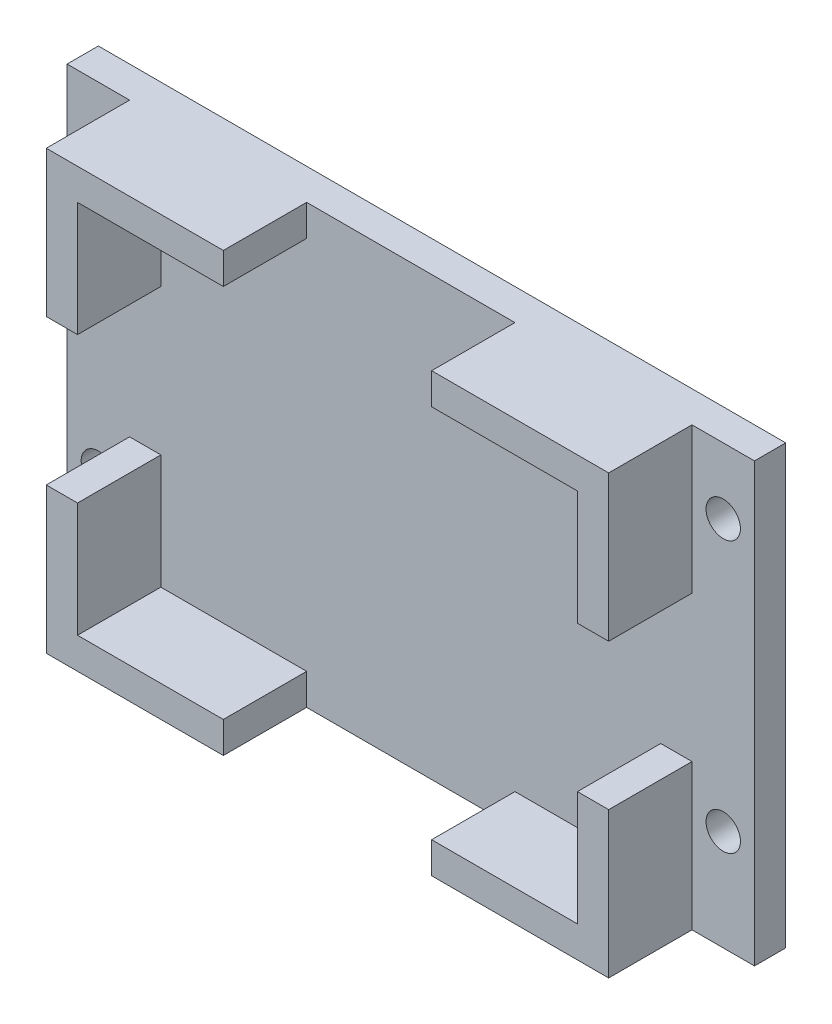
ISO-10303-21;
HEADER;
FILE_DESCRIPTION(('STEP AP214'),'2;1');
FILE_NAME('part.step','',(''),(''),'','','');
FILE_SCHEMA(('AUTOMOTIVE_DESIGN { 1 0 10303 214 1 1 1 1 }'));
ENDSEC;
DATA;
#1=APPLICATION_CONTEXT('core data for automotive mechanical design processes');
#2=APPLICATION_PROTOCOL_DEFINITION('international standard','automotive_design',2000,#1);
#3=PRODUCT_CONTEXT('',#1,'mechanical');
#4=PRODUCT('Part','Part','',(#3));
#5=PRODUCT_RELATED_PRODUCT_CATEGORY('part','',(#4));
#6=PRODUCT_DEFINITION_FORMATION('','',#4);
#7=PRODUCT_DEFINITION_CONTEXT('part definition',#1,'design');
#8=PRODUCT_DEFINITION('design','',#6,#7);
#9=PRODUCT_DEFINITION_SHAPE('','',#8);
#10=(LENGTH_UNIT() NAMED_UNIT(*) SI_UNIT(.MILLI.,.METRE.));
#11=(NAMED_UNIT(*) PLANE_ANGLE_UNIT() SI_UNIT($,.RADIAN.));
#12=(NAMED_UNIT(*) SI_UNIT($,.STERADIAN.) SOLID_ANGLE_UNIT());
#13=UNCERTAINTY_MEASURE_WITH_UNIT(LENGTH_MEASURE(1.E-05),#10,'distance_accuracy_value','');
#14=(GEOMETRIC_REPRESENTATION_CONTEXT(3) GLOBAL_UNCERTAINTY_ASSIGNED_CONTEXT((#13)) GLOBAL_UNIT_ASSIGNED_CONTEXT((#10,
#11,#12)) REPRESENTATION_CONTEXT('',''));
#15=CARTESIAN_POINT('',(0.,0.,0.));
#16=DIRECTION('',(0.,0.,1.));
#17=DIRECTION('',(1.,0.,0.));
#18=AXIS2_PLACEMENT_3D('',#15,#16,#17);
#19=CARTESIAN_POINT('',(0.,0.,11.));
#20=DIRECTION('',(0.,0.,1.));
#21=DIRECTION('',(1.,0.,0.));
#22=AXIS2_PLACEMENT_3D('',#19,#20,#21);
#23=PLANE('',#22);
#24=DIRECTION('',(-1.,0.,0.));
#25=VECTOR('',#24,1.);
#26=CARTESIAN_POINT('',(33.,-6.99999999999999,11.));
#27=LINE('',#26,#25);
#28=CARTESIAN_POINT('',(-24.,-7.,11.));
#29=VERTEX_POINT('',#28);
#30=CARTESIAN_POINT('',(-27.,-7.,11.));
#31=VERTEX_POINT('',#30);
#32=EDGE_CURVE('E601',#29,#31,#27,.T.);
#33=ORIENTED_EDGE('',*,*,#32,.T.);
#34=DIRECTION('',(0.,-1.,0.));
#35=VECTOR('',#34,1.);
#36=CARTESIAN_POINT('',(-27.,21.,11.));
#37=LINE('',#36,#35);
#38=CARTESIAN_POINT('',(-27.,-21.,11.));
#39=VERTEX_POINT('',#38);
#40=EDGE_CURVE('E243',#31,#39,#37,.T.);
#41=ORIENTED_EDGE('',*,*,#40,.T.);
#42=DIRECTION('',(1.,0.,0.));
#43=VECTOR('',#42,1.);
#44=CARTESIAN_POINT('',(-27.,-21.,11.));
#45=LINE('',#44,#43);
#46=CARTESIAN_POINT('',(-10.,-21.,11.));
#47=VERTEX_POINT('',#46);
#48=EDGE_CURVE('E245',#39,#47,#45,.T.);
#49=ORIENTED_EDGE('',*,*,#48,.T.);
#50=DIRECTION('',(0.,1.,0.));
#51=VECTOR('',#50,1.);
#52=CARTESIAN_POINT('',(-10.,-119.75,11.));
#53=LINE('',#52,#51);
#54=CARTESIAN_POINT('',(-10.,-18.,11.));
#55=VERTEX_POINT('',#54);
#56=EDGE_CURVE('E449',#47,#55,#53,.T.);
#57=ORIENTED_EDGE('',*,*,#56,.T.);
#58=DIRECTION('',(1.,0.,0.));
#59=VECTOR('',#58,1.);
#60=CARTESIAN_POINT('',(-24.,-18.,11.));
#61=LINE('',#60,#59);
#62=CARTESIAN_POINT('',(-24.,-18.,11.));
#63=VERTEX_POINT('',#62);
#64=EDGE_CURVE('E339',#63,#55,#61,.T.);
#65=ORIENTED_EDGE('',*,*,#64,.F.);
#66=DIRECTION('',(0.,-1.,0.));
#67=VECTOR('',#66,1.);
#68=CARTESIAN_POINT('',(-24.,18.,11.));
#69=LINE('',#68,#67);
#70=EDGE_CURVE('E473',#29,#63,#69,.T.);
#71=ORIENTED_EDGE('',*,*,#70,.F.);
#72=EDGE_LOOP('',(#33,#41,#49,#57,#65,#71));
#73=FACE_BOUND('',#72,.T.);
#74=ADVANCED_FACE('F36',(#73),#23,.T.);
#75=CARTESIAN_POINT('',(27.,-7.,11.));
#76=VERTEX_POINT('',#75);
#77=CARTESIAN_POINT('',(24.,-7.,11.));
#78=VERTEX_POINT('',#77);
#79=EDGE_CURVE('E427',#76,#78,#27,.T.);
#80=ORIENTED_EDGE('',*,*,#79,.T.);
#81=DIRECTION('',(0.,1.,0.));
#82=VECTOR('',#81,1.);
#83=CARTESIAN_POINT('',(24.,18.,11.));
#84=LINE('',#83,#82);
#85=CARTESIAN_POINT('',(24.,-18.,11.));
#86=VERTEX_POINT('',#85);
#87=EDGE_CURVE('E355',#86,#78,#84,.T.);
#88=ORIENTED_EDGE('',*,*,#87,.F.);
#89=CARTESIAN_POINT('',(10.,-18.,11.));
#90=VERTEX_POINT('',#89);
#91=EDGE_CURVE('E476',#90,#86,#61,.T.);
#92=ORIENTED_EDGE('',*,*,#91,.F.);
#93=DIRECTION('',(0.,1.,0.));
#94=VECTOR('',#93,1.);
#95=CARTESIAN_POINT('',(10.,-119.75,11.));
#96=LINE('',#95,#94);
#97=CARTESIAN_POINT('',(10.,-21.,11.));
#98=VERTEX_POINT('',#97);
#99=EDGE_CURVE('E440',#98,#90,#96,.T.);
#100=ORIENTED_EDGE('',*,*,#99,.F.);
#101=CARTESIAN_POINT('',(27.,-21.,11.));
#102=VERTEX_POINT('',#101);
#103=EDGE_CURVE('E242',#98,#102,#45,.T.);
#104=ORIENTED_EDGE('',*,*,#103,.T.);
#105=DIRECTION('',(0.,1.,0.));
#106=VECTOR('',#105,1.);
#107=CARTESIAN_POINT('',(27.,21.,11.));
#108=LINE('',#107,#106);
#109=EDGE_CURVE('E371',#102,#76,#108,.T.);
#110=ORIENTED_EDGE('',*,*,#109,.T.);
#111=EDGE_LOOP('',(#80,#88,#92,#100,#104,#110));
#112=FACE_BOUND('',#111,.T.);
#113=ADVANCED_FACE('F507',(#112),#23,.T.);
#114=CARTESIAN_POINT('',(27.,21.,11.));
#115=DIRECTION('',(-1.,0.,0.));
#116=DIRECTION('',(0.,-1.,0.));
#117=AXIS2_PLACEMENT_3D('',#114,#115,#116);
#118=PLANE('',#117);
#119=DIRECTION('',(0.,1.,0.));
#120=VECTOR('',#119,1.);
#121=CARTESIAN_POINT('',(27.,21.,3.));
#122=LINE('',#121,#120);
#123=CARTESIAN_POINT('',(27.,-21.,3.));
#124=VERTEX_POINT('',#123);
#125=CARTESIAN_POINT('',(27.,-6.99999999999999,3.));
#126=VERTEX_POINT('',#125);
#127=EDGE_CURVE('E253',#124,#126,#122,.T.);
#128=ORIENTED_EDGE('',*,*,#127,.T.);
#129=DIRECTION('',(0.,0.,1.));
#130=VECTOR('',#129,1.);
#131=CARTESIAN_POINT('',(27.,-6.99999999999999,11.));
#132=LINE('',#131,#130);
#133=EDGE_CURVE('E434',#126,#76,#132,.T.);
#134=ORIENTED_EDGE('',*,*,#133,.T.);
#135=ORIENTED_EDGE('',*,*,#109,.F.);
#136=DIRECTION('',(0.,0.,-1.));
#137=VECTOR('',#136,1.);
#138=CARTESIAN_POINT('',(27.,-21.,11.));
#139=LINE('',#138,#137);
#140=EDGE_CURVE('E252',#102,#124,#139,.T.);
#141=ORIENTED_EDGE('',*,*,#140,.T.);
#142=EDGE_LOOP('',(#128,#134,#135,#141));
#143=FACE_BOUND('',#142,.T.);
#144=ADVANCED_FACE('F514',(#143),#118,.F.);
#145=CARTESIAN_POINT('',(-27.,21.,11.));
#146=DIRECTION('',(1.,0.,0.));
#147=DIRECTION('',(0.,1.,0.));
#148=AXIS2_PLACEMENT_3D('',#145,#146,#147);
#149=PLANE('',#148);
#150=ORIENTED_EDGE('',*,*,#40,.F.);
#151=DIRECTION('',(0.,0.,1.));
#152=VECTOR('',#151,1.);
#153=CARTESIAN_POINT('',(-27.,-7.,3.));
#154=LINE('',#153,#152);
#155=CARTESIAN_POINT('',(-27.,-7.,3.));
#156=VERTEX_POINT('',#155);
#157=EDGE_CURVE('E228',#156,#31,#154,.T.);
#158=ORIENTED_EDGE('',*,*,#157,.F.);
#159=DIRECTION('',(0.,-1.,0.));
#160=VECTOR('',#159,1.);
#161=CARTESIAN_POINT('',(-27.,21.,3.));
#162=LINE('',#161,#160);
#163=CARTESIAN_POINT('',(-27.,-21.,3.));
#164=VERTEX_POINT('',#163);
#165=EDGE_CURVE('E256',#156,#164,#162,.T.);
#166=ORIENTED_EDGE('',*,*,#165,.T.);
#167=DIRECTION('',(0.,0.,-1.));
#168=VECTOR('',#167,1.);
#169=CARTESIAN_POINT('',(-27.,-21.,11.));
#170=LINE('',#169,#168);
#171=EDGE_CURVE('E262',#39,#164,#170,.T.);
#172=ORIENTED_EDGE('',*,*,#171,.F.);
#173=EDGE_LOOP('',(#150,#158,#166,#172));
#174=FACE_BOUND('',#173,.T.);
#175=ADVANCED_FACE('F581',(#174),#149,.F.);
#176=CARTESIAN_POINT('',(24.,18.,11.));
#177=DIRECTION('',(-1.,0.,0.));
#178=DIRECTION('',(0.,0.,1.));
#179=AXIS2_PLACEMENT_3D('',#176,#177,#178);
#180=PLANE('',#179);
#181=DIRECTION('',(0.,0.,1.));
#182=VECTOR('',#181,1.);
#183=CARTESIAN_POINT('',(24.,-6.99999999999999,11.));
#184=LINE('',#183,#182);
#185=CARTESIAN_POINT('',(24.,-7.,3.));
#186=VERTEX_POINT('',#185);
#187=EDGE_CURVE('E432',#186,#78,#184,.T.);
#188=ORIENTED_EDGE('',*,*,#187,.F.);
#189=DIRECTION('',(0.,1.,0.));
#190=VECTOR('',#189,1.);
#191=CARTESIAN_POINT('',(24.,18.,3.));
#192=LINE('',#191,#190);
#193=CARTESIAN_POINT('',(24.,-18.,3.));
#194=VERTEX_POINT('',#193);
#195=EDGE_CURVE('E478',#194,#186,#192,.T.);
#196=ORIENTED_EDGE('',*,*,#195,.F.);
#197=DIRECTION('',(0.,0.,-1.));
#198=VECTOR('',#197,1.);
#199=CARTESIAN_POINT('',(24.,-18.,11.));
#200=LINE('',#199,#198);
#201=EDGE_CURVE('E361',#86,#194,#200,.T.);
#202=ORIENTED_EDGE('',*,*,#201,.F.);
#203=ORIENTED_EDGE('',*,*,#87,.T.);
#204=EDGE_LOOP('',(#188,#196,#202,#203));
#205=FACE_BOUND('',#204,.T.);
#206=ADVANCED_FACE('F586',(#205),#180,.T.);
#207=CARTESIAN_POINT('',(-24.,18.,11.));
#208=DIRECTION('',(1.,0.,0.));
#209=DIRECTION('',(0.,0.,-1.));
#210=AXIS2_PLACEMENT_3D('',#207,#208,#209);
#211=PLANE('',#210);
#212=DIRECTION('',(0.,0.,-1.));
#213=VECTOR('',#212,1.);
#214=CARTESIAN_POINT('',(-24.,-7.,11.));
#215=LINE('',#214,#213);
#216=CARTESIAN_POINT('',(-24.,-7.,3.));
#217=VERTEX_POINT('',#216);
#218=EDGE_CURVE('E430',#29,#217,#215,.T.);
#219=ORIENTED_EDGE('',*,*,#218,.F.);
#220=ORIENTED_EDGE('',*,*,#70,.T.);
#221=DIRECTION('',(0.,0.,-1.));
#222=VECTOR('',#221,1.);
#223=CARTESIAN_POINT('',(-24.,-18.,11.));
#224=LINE('',#223,#222);
#225=CARTESIAN_POINT('',(-24.,-18.,3.));
#226=VERTEX_POINT('',#225);
#227=EDGE_CURVE('E364',#63,#226,#224,.T.);
#228=ORIENTED_EDGE('',*,*,#227,.T.);
#229=DIRECTION('',(0.,-1.,0.));
#230=VECTOR('',#229,1.);
#231=CARTESIAN_POINT('',(-24.,18.,3.));
#232=LINE('',#231,#230);
#233=EDGE_CURVE('E350',#217,#226,#232,.T.);
#234=ORIENTED_EDGE('',*,*,#233,.F.);
#235=EDGE_LOOP('',(#219,#220,#228,#234));
#236=FACE_BOUND('',#235,.T.);
#237=ADVANCED_FACE('F540',(#236),#211,.T.);
#238=CARTESIAN_POINT('',(0.,-21.,3.));
#239=DIRECTION('',(0.,-1.,0.));
#240=DIRECTION('',(0.,0.,-1.));
#241=AXIS2_PLACEMENT_3D('',#238,#239,#240);
#242=PLANE('',#241);
#243=DIRECTION('',(-1.,0.,0.));
#244=VECTOR('',#243,1.);
#245=CARTESIAN_POINT('',(0.,-21.,3.));
#246=LINE('',#245,#244);
#247=CARTESIAN_POINT('',(10.,-21.,3.));
#248=VERTEX_POINT('',#247);
#249=CARTESIAN_POINT('',(-10.,-21.,3.));
#250=VERTEX_POINT('',#249);
#251=EDGE_CURVE('E465',#248,#250,#246,.T.);
#252=ORIENTED_EDGE('',*,*,#251,.T.);
#253=DIRECTION('',(0.,0.,1.));
#254=VECTOR('',#253,1.);
#255=CARTESIAN_POINT('',(-10.,-21.,3.));
#256=LINE('',#255,#254);
#257=EDGE_CURVE('E462',#250,#47,#256,.T.);
#258=ORIENTED_EDGE('',*,*,#257,.T.);
#259=ORIENTED_EDGE('',*,*,#48,.F.);
#260=ORIENTED_EDGE('',*,*,#171,.T.);
#261=DIRECTION('',(-1.,0.,0.));
#262=VECTOR('',#261,1.);
#263=CARTESIAN_POINT('',(0.,-21.,3.));
#264=LINE('',#263,#262);
#265=CARTESIAN_POINT('',(-33.,-21.,3.));
#266=VERTEX_POINT('',#265);
#267=EDGE_CURVE('E278',#164,#266,#264,.T.);
#268=ORIENTED_EDGE('',*,*,#267,.T.);
#269=DIRECTION('',(0.,0.,-1.));
#270=VECTOR('',#269,1.);
#271=CARTESIAN_POINT('',(-33.,-21.,3.));
#272=LINE('',#271,#270);
#273=CARTESIAN_POINT('',(-33.,-21.,0.));
#274=VERTEX_POINT('',#273);
#275=EDGE_CURVE('E297',#266,#274,#272,.T.);
#276=ORIENTED_EDGE('',*,*,#275,.T.);
#277=DIRECTION('',(-1.,0.,0.));
#278=VECTOR('',#277,1.);
#279=CARTESIAN_POINT('',(0.,-21.,0.));
#280=LINE('',#279,#278);
#281=CARTESIAN_POINT('',(33.,-21.,0.));
#282=VERTEX_POINT('',#281);
#283=EDGE_CURVE('E303',#282,#274,#280,.T.);
#284=ORIENTED_EDGE('',*,*,#283,.F.);
#285=DIRECTION('',(0.,0.,-1.));
#286=VECTOR('',#285,1.);
#287=CARTESIAN_POINT('',(33.,-21.,3.));
#288=LINE('',#287,#286);
#289=CARTESIAN_POINT('',(33.,-21.,3.));
#290=VERTEX_POINT('',#289);
#291=EDGE_CURVE('E326',#290,#282,#288,.T.);
#292=ORIENTED_EDGE('',*,*,#291,.F.);
#293=EDGE_CURVE('E279',#290,#124,#264,.T.);
#294=ORIENTED_EDGE('',*,*,#293,.T.);
#295=ORIENTED_EDGE('',*,*,#140,.F.);
#296=ORIENTED_EDGE('',*,*,#103,.F.);
#297=DIRECTION('',(0.,0.,-1.));
#298=VECTOR('',#297,1.);
#299=CARTESIAN_POINT('',(10.,-21.,3.));
#300=LINE('',#299,#298);
#301=EDGE_CURVE('E454',#98,#248,#300,.T.);
#302=ORIENTED_EDGE('',*,*,#301,.T.);
#303=EDGE_LOOP('',(#252,#258,#259,#260,#268,#276,#284,#292,#294,#295,#296,#302));
#304=FACE_BOUND('',#303,.T.);
#305=ADVANCED_FACE('F410',(#304),#242,.T.);
#306=CARTESIAN_POINT('',(0.,21.,3.));
#307=DIRECTION('',(0.,-1.,0.));
#308=DIRECTION('',(0.,0.,-1.));
#309=AXIS2_PLACEMENT_3D('',#306,#307,#308);
#310=PLANE('',#309);
#311=DIRECTION('',(0.,0.,1.));
#312=VECTOR('',#311,1.);
#313=CARTESIAN_POINT('',(-10.,21.,3.));
#314=LINE('',#313,#312);
#315=CARTESIAN_POINT('',(-10.,21.,3.));
#316=VERTEX_POINT('',#315);
#317=CARTESIAN_POINT('',(-10.,21.,11.));
#318=VERTEX_POINT('',#317);
#319=EDGE_CURVE('E460',#316,#318,#314,.T.);
#320=ORIENTED_EDGE('',*,*,#319,.F.);
#321=DIRECTION('',(-1.,0.,0.));
#322=VECTOR('',#321,1.);
#323=CARTESIAN_POINT('',(0.,21.,3.));
#324=LINE('',#323,#322);
#325=CARTESIAN_POINT('',(10.,21.,3.));
#326=VERTEX_POINT('',#325);
#327=EDGE_CURVE('E11',#326,#316,#324,.T.);
#328=ORIENTED_EDGE('',*,*,#327,.F.);
#329=DIRECTION('',(0.,0.,-1.));
#330=VECTOR('',#329,1.);
#331=CARTESIAN_POINT('',(10.,21.,3.));
#332=LINE('',#331,#330);
#333=CARTESIAN_POINT('',(10.,21.,11.));
#334=VERTEX_POINT('',#333);
#335=EDGE_CURVE('E392',#334,#326,#332,.T.);
#336=ORIENTED_EDGE('',*,*,#335,.F.);
#337=DIRECTION('',(-1.,0.,0.));
#338=VECTOR('',#337,1.);
#339=CARTESIAN_POINT('',(-27.,21.,11.));
#340=LINE('',#339,#338);
#341=CARTESIAN_POINT('',(27.,21.,11.));
#342=VERTEX_POINT('',#341);
#343=EDGE_CURVE('E247',#342,#334,#340,.T.);
#344=ORIENTED_EDGE('',*,*,#343,.F.);
#345=DIRECTION('',(0.,0.,-1.));
#346=VECTOR('',#345,1.);
#347=CARTESIAN_POINT('',(27.,21.,11.));
#348=LINE('',#347,#346);
#349=CARTESIAN_POINT('',(27.,21.,3.));
#350=VERTEX_POINT('',#349);
#351=EDGE_CURVE('E267',#342,#350,#348,.T.);
#352=ORIENTED_EDGE('',*,*,#351,.T.);
#353=DIRECTION('',(-1.,0.,0.));
#354=VECTOR('',#353,1.);
#355=CARTESIAN_POINT('',(0.,21.,3.));
#356=LINE('',#355,#354);
#357=CARTESIAN_POINT('',(33.,21.,3.));
#358=VERTEX_POINT('',#357);
#359=EDGE_CURVE('E285',#358,#350,#356,.T.);
#360=ORIENTED_EDGE('',*,*,#359,.F.);
#361=DIRECTION('',(0.,0.,-1.));
#362=VECTOR('',#361,1.);
#363=CARTESIAN_POINT('',(33.,21.,3.));
#364=LINE('',#363,#362);
#365=CARTESIAN_POINT('',(33.,21.,0.));
#366=VERTEX_POINT('',#365);
#367=EDGE_CURVE('E324',#358,#366,#364,.T.);
#368=ORIENTED_EDGE('',*,*,#367,.T.);
#369=DIRECTION('',(-1.,0.,0.));
#370=VECTOR('',#369,1.);
#371=CARTESIAN_POINT('',(0.,21.,0.));
#372=LINE('',#371,#370);
#373=CARTESIAN_POINT('',(-33.,21.,0.));
#374=VERTEX_POINT('',#373);
#375=EDGE_CURVE('E309',#366,#374,#372,.T.);
#376=ORIENTED_EDGE('',*,*,#375,.T.);
#377=DIRECTION('',(0.,0.,-1.));
#378=VECTOR('',#377,1.);
#379=CARTESIAN_POINT('',(-33.,21.,3.));
#380=LINE('',#379,#378);
#381=CARTESIAN_POINT('',(-33.,21.,3.));
#382=VERTEX_POINT('',#381);
#383=EDGE_CURVE('E321',#382,#374,#380,.T.);
#384=ORIENTED_EDGE('',*,*,#383,.F.);
#385=CARTESIAN_POINT('',(-27.,21.,3.));
#386=VERTEX_POINT('',#385);
#387=EDGE_CURVE('E284',#386,#382,#356,.T.);
#388=ORIENTED_EDGE('',*,*,#387,.F.);
#389=DIRECTION('',(0.,0.,-1.));
#390=VECTOR('',#389,1.);
#391=CARTESIAN_POINT('',(-27.,21.,11.));
#392=LINE('',#391,#390);
#393=CARTESIAN_POINT('',(-27.,21.,11.));
#394=VERTEX_POINT('',#393);
#395=EDGE_CURVE('E265',#394,#386,#392,.T.);
#396=ORIENTED_EDGE('',*,*,#395,.F.);
#397=EDGE_CURVE('E240',#318,#394,#340,.T.);
#398=ORIENTED_EDGE('',*,*,#397,.F.);
#399=EDGE_LOOP('',(#320,#328,#336,#344,#352,#360,#368,#376,#384,#388,#396,#398));
#400=FACE_BOUND('',#399,.T.);
#401=ADVANCED_FACE('F389',(#400),#310,.F.);
#402=DIRECTION('',(-1.,0.,0.));
#403=VECTOR('',#402,1.);
#404=CARTESIAN_POINT('',(33.,7.00000000000001,11.));
#405=LINE('',#404,#403);
#406=CARTESIAN_POINT('',(-24.,7.,11.));
#407=VERTEX_POINT('',#406);
#408=CARTESIAN_POINT('',(-27.,7.,11.));
#409=VERTEX_POINT('',#408);
#410=EDGE_CURVE('E218',#407,#409,#405,.T.);
#411=ORIENTED_EDGE('',*,*,#410,.F.);
#412=CARTESIAN_POINT('',(-24.,18.,11.));
#413=VERTEX_POINT('',#412);
#414=EDGE_CURVE('E474',#413,#407,#69,.T.);
#415=ORIENTED_EDGE('',*,*,#414,.F.);
#416=DIRECTION('',(-1.,0.,0.));
#417=VECTOR('',#416,1.);
#418=CARTESIAN_POINT('',(-24.,18.,11.));
#419=LINE('',#418,#417);
#420=CARTESIAN_POINT('',(-10.,17.9999999999999,11.));
#421=VERTEX_POINT('',#420);
#422=EDGE_CURVE('E469',#421,#413,#419,.T.);
#423=ORIENTED_EDGE('',*,*,#422,.F.);
#424=EDGE_CURVE('E447',#421,#318,#53,.T.);
#425=ORIENTED_EDGE('',*,*,#424,.T.);
#426=ORIENTED_EDGE('',*,*,#397,.T.);
#427=EDGE_CURVE('E234',#394,#409,#37,.T.);
#428=ORIENTED_EDGE('',*,*,#427,.T.);
#429=EDGE_LOOP('',(#411,#415,#423,#425,#426,#428));
#430=FACE_BOUND('',#429,.T.);
#431=ADVANCED_FACE('F237',(#430),#23,.T.);
#432=CARTESIAN_POINT('',(-24.,18.,11.));
#433=DIRECTION('',(0.,-1.,0.));
#434=DIRECTION('',(0.,0.,-1.));
#435=AXIS2_PLACEMENT_3D('',#432,#433,#434);
#436=PLANE('',#435);
#437=DIRECTION('',(-1.,0.,0.));
#438=VECTOR('',#437,1.);
#439=CARTESIAN_POINT('',(-24.,18.,3.));
#440=LINE('',#439,#438);
#441=CARTESIAN_POINT('',(-10.,17.9999999999999,3.));
#442=VERTEX_POINT('',#441);
#443=CARTESIAN_POINT('',(-24.,18.,3.));
#444=VERTEX_POINT('',#443);
#445=EDGE_CURVE('E480',#442,#444,#440,.T.);
#446=ORIENTED_EDGE('',*,*,#445,.F.);
#447=DIRECTION('',(0.,0.,1.));
#448=VECTOR('',#447,1.);
#449=CARTESIAN_POINT('',(-10.,18.,11.));
#450=LINE('',#449,#448);
#451=EDGE_CURVE('E457',#442,#421,#450,.T.);
#452=ORIENTED_EDGE('',*,*,#451,.T.);
#453=ORIENTED_EDGE('',*,*,#422,.T.);
#454=DIRECTION('',(0.,0.,-1.));
#455=VECTOR('',#454,1.);
#456=CARTESIAN_POINT('',(-24.,18.,11.));
#457=LINE('',#456,#455);
#458=EDGE_CURVE('E366',#413,#444,#457,.T.);
#459=ORIENTED_EDGE('',*,*,#458,.T.);
#460=EDGE_LOOP('',(#446,#452,#453,#459));
#461=FACE_BOUND('',#460,.T.);
#462=ADVANCED_FACE('F488',(#461),#436,.T.);
#463=CARTESIAN_POINT('',(24.,18.,11.));
#464=VERTEX_POINT('',#463);
#465=CARTESIAN_POINT('',(10.,17.9999999999999,11.));
#466=VERTEX_POINT('',#465);
#467=EDGE_CURVE('E470',#464,#466,#419,.T.);
#468=ORIENTED_EDGE('',*,*,#467,.T.);
#469=DIRECTION('',(0.,0.,-1.));
#470=VECTOR('',#469,1.);
#471=CARTESIAN_POINT('',(10.,18.,11.));
#472=LINE('',#471,#470);
#473=CARTESIAN_POINT('',(10.,18.,3.));
#474=VERTEX_POINT('',#473);
#475=EDGE_CURVE('E450',#466,#474,#472,.T.);
#476=ORIENTED_EDGE('',*,*,#475,.T.);
#477=CARTESIAN_POINT('',(24.,18.,3.));
#478=VERTEX_POINT('',#477);
#479=EDGE_CURVE('E481',#478,#474,#440,.T.);
#480=ORIENTED_EDGE('',*,*,#479,.F.);
#481=DIRECTION('',(0.,0.,-1.));
#482=VECTOR('',#481,1.);
#483=CARTESIAN_POINT('',(24.,18.,11.));
#484=LINE('',#483,#482);
#485=EDGE_CURVE('E369',#464,#478,#484,.T.);
#486=ORIENTED_EDGE('',*,*,#485,.F.);
#487=EDGE_LOOP('',(#468,#476,#480,#486));
#488=FACE_BOUND('',#487,.T.);
#489=ADVANCED_FACE('F533',(#488),#436,.T.);
#490=CARTESIAN_POINT('',(-24.,-18.,11.));
#491=DIRECTION('',(0.,1.,0.));
#492=DIRECTION('',(0.,0.,1.));
#493=AXIS2_PLACEMENT_3D('',#490,#491,#492);
#494=PLANE('',#493);
#495=ORIENTED_EDGE('',*,*,#64,.T.);
#496=DIRECTION('',(0.,0.,-1.));
#497=VECTOR('',#496,1.);
#498=CARTESIAN_POINT('',(-10.,-18.,11.));
#499=LINE('',#498,#497);
#500=CARTESIAN_POINT('',(-10.,-18.,3.));
#501=VERTEX_POINT('',#500);
#502=EDGE_CURVE('E44',#55,#501,#499,.T.);
#503=ORIENTED_EDGE('',*,*,#502,.T.);
#504=DIRECTION('',(1.,0.,0.));
#505=VECTOR('',#504,1.);
#506=CARTESIAN_POINT('',(-24.,-18.,3.));
#507=LINE('',#506,#505);
#508=EDGE_CURVE('E337',#226,#501,#507,.T.);
#509=ORIENTED_EDGE('',*,*,#508,.F.);
#510=ORIENTED_EDGE('',*,*,#227,.F.);
#511=EDGE_LOOP('',(#495,#503,#509,#510));
#512=FACE_BOUND('',#511,.T.);
#513=ADVANCED_FACE('F335',(#512),#494,.T.);
#514=CARTESIAN_POINT('',(10.,-18.,3.));
#515=VERTEX_POINT('',#514);
#516=EDGE_CURVE('E353',#515,#194,#507,.T.);
#517=ORIENTED_EDGE('',*,*,#516,.F.);
#518=DIRECTION('',(0.,0.,1.));
#519=VECTOR('',#518,1.);
#520=CARTESIAN_POINT('',(10.,-18.,11.));
#521=LINE('',#520,#519);
#522=EDGE_CURVE('E328',#515,#90,#521,.T.);
#523=ORIENTED_EDGE('',*,*,#522,.T.);
#524=ORIENTED_EDGE('',*,*,#91,.T.);
#525=ORIENTED_EDGE('',*,*,#201,.T.);
#526=EDGE_LOOP('',(#517,#523,#524,#525));
#527=FACE_BOUND('',#526,.T.);
#528=ADVANCED_FACE('F546',(#527),#494,.T.);
#529=CARTESIAN_POINT('',(33.,0.,3.));
#530=DIRECTION('',(1.,0.,0.));
#531=DIRECTION('',(0.,0.,-1.));
#532=AXIS2_PLACEMENT_3D('',#529,#530,#531);
#533=PLANE('',#532);
#534=DIRECTION('',(0.,-1.,0.));
#535=VECTOR('',#534,1.);
#536=CARTESIAN_POINT('',(33.,0.,0.));
#537=LINE('',#536,#535);
#538=EDGE_CURVE('E306',#366,#282,#537,.T.);
#539=ORIENTED_EDGE('',*,*,#538,.F.);
#540=ORIENTED_EDGE('',*,*,#367,.F.);
#541=DIRECTION('',(0.,-1.,0.));
#542=VECTOR('',#541,1.);
#543=CARTESIAN_POINT('',(33.,0.,3.));
#544=LINE('',#543,#542);
#545=EDGE_CURVE('E282',#358,#290,#544,.T.);
#546=ORIENTED_EDGE('',*,*,#545,.T.);
#547=ORIENTED_EDGE('',*,*,#291,.T.);
#548=EDGE_LOOP('',(#539,#540,#546,#547));
#549=FACE_BOUND('',#548,.T.);
#550=ADVANCED_FACE('F406',(#549),#533,.T.);
#551=CARTESIAN_POINT('',(30.,-11.3167688964495,3.));
#552=DIRECTION('',(0.,0.,-1.));
#553=DIRECTION('',(-1.,0.,0.));
#554=AXIS2_PLACEMENT_3D('',#551,#552,#553);
#555=CYLINDRICAL_SURFACE('',#554,1.65);
#556=CARTESIAN_POINT('',(30.,-11.3167688964495,3.));
#557=DIRECTION('',(0.,0.,1.));
#558=DIRECTION('',(1.,0.,0.));
#559=AXIS2_PLACEMENT_3D('',#556,#557,#558);
#560=CIRCLE('',#559,1.65);
#561=CARTESIAN_POINT('',(31.65,-11.3167688964495,3.));
#562=VERTEX_POINT('',#561);
#563=EDGE_CURVE('E291',#562,#562,#560,.F.);
#564=ORIENTED_EDGE('',*,*,#563,.F.);
#565=EDGE_LOOP('',(#564));
#566=FACE_BOUND('',#565,.T.);
#567=CARTESIAN_POINT('',(30.,-11.3167688964495,0.));
#568=DIRECTION('',(0.,0.,1.));
#569=DIRECTION('',(1.,0.,0.));
#570=AXIS2_PLACEMENT_3D('',#567,#568,#569);
#571=CIRCLE('',#570,1.65);
#572=CARTESIAN_POINT('',(31.65,-11.3167688964495,0.));
#573=VERTEX_POINT('',#572);
#574=EDGE_CURVE('E315',#573,#573,#571,.F.);
#575=ORIENTED_EDGE('',*,*,#574,.T.);
#576=EDGE_LOOP('',(#575));
#577=FACE_BOUND('',#576,.T.);
#578=ADVANCED_FACE('F545',(#566,#577),#555,.F.);
#579=CARTESIAN_POINT('',(-33.,0.,3.));
#580=DIRECTION('',(1.,0.,0.));
#581=DIRECTION('',(0.,0.,-1.));
#582=AXIS2_PLACEMENT_3D('',#579,#580,#581);
#583=PLANE('',#582);
#584=DIRECTION('',(0.,-1.,0.));
#585=VECTOR('',#584,1.);
#586=CARTESIAN_POINT('',(-33.,0.,0.));
#587=LINE('',#586,#585);
#588=EDGE_CURVE('E312',#374,#274,#587,.T.);
#589=ORIENTED_EDGE('',*,*,#588,.T.);
#590=ORIENTED_EDGE('',*,*,#275,.F.);
#591=DIRECTION('',(0.,-1.,0.));
#592=VECTOR('',#591,1.);
#593=CARTESIAN_POINT('',(-33.,0.,3.));
#594=LINE('',#593,#592);
#595=EDGE_CURVE('E288',#382,#266,#594,.T.);
#596=ORIENTED_EDGE('',*,*,#595,.F.);
#597=ORIENTED_EDGE('',*,*,#383,.T.);
#598=EDGE_LOOP('',(#589,#590,#596,#597));
#599=FACE_BOUND('',#598,.T.);
#600=ADVANCED_FACE('F415',(#599),#583,.F.);
#601=CARTESIAN_POINT('',(-30.,14.6832311035505,3.));
#602=DIRECTION('',(0.,0.,-1.));
#603=DIRECTION('',(-1.,0.,0.));
#604=AXIS2_PLACEMENT_3D('',#601,#602,#603);
#605=CYLINDRICAL_SURFACE('',#604,1.65);
#606=CARTESIAN_POINT('',(-30.,14.6832311035505,3.));
#607=DIRECTION('',(0.,0.,1.));
#608=DIRECTION('',(1.,0.,0.));
#609=AXIS2_PLACEMENT_3D('',#606,#607,#608);
#610=CIRCLE('',#609,1.65);
#611=CARTESIAN_POINT('',(-28.35,14.6832311035505,3.));
#612=VERTEX_POINT('',#611);
#613=EDGE_CURVE('E274',#612,#612,#610,.T.);
#614=ORIENTED_EDGE('',*,*,#613,.T.);
#615=EDGE_LOOP('',(#614));
#616=FACE_BOUND('',#615,.T.);
#617=CARTESIAN_POINT('',(-30.,14.6832311035505,0.));
#618=DIRECTION('',(0.,0.,1.));
#619=DIRECTION('',(1.,0.,0.));
#620=AXIS2_PLACEMENT_3D('',#617,#618,#619);
#621=CIRCLE('',#620,1.65);
#622=CARTESIAN_POINT('',(-28.35,14.6832311035505,0.));
#623=VERTEX_POINT('',#622);
#624=EDGE_CURVE('E300',#623,#623,#621,.T.);
#625=ORIENTED_EDGE('',*,*,#624,.F.);
#626=EDGE_LOOP('',(#625));
#627=FACE_BOUND('',#626,.T.);
#628=ADVANCED_FACE('F547',(#616,#627),#605,.F.);
#629=CARTESIAN_POINT('',(-30.,-11.3167688964495,3.));
#630=DIRECTION('',(0.,0.,-1.));
#631=DIRECTION('',(-1.,0.,0.));
#632=AXIS2_PLACEMENT_3D('',#629,#630,#631);
#633=CYLINDRICAL_SURFACE('',#632,1.65);
#634=CARTESIAN_POINT('',(-30.,-11.3167688964495,3.));
#635=DIRECTION('',(0.,0.,1.));
#636=DIRECTION('',(1.,0.,0.));
#637=AXIS2_PLACEMENT_3D('',#634,#635,#636);
#638=CIRCLE('',#637,1.65);
#639=CARTESIAN_POINT('',(-28.35,-11.3167688964495,3.));
#640=VERTEX_POINT('',#639);
#641=EDGE_CURVE('E271',#640,#640,#638,.T.);
#642=ORIENTED_EDGE('',*,*,#641,.T.);
#643=EDGE_LOOP('',(#642));
#644=FACE_BOUND('',#643,.T.);
#645=CARTESIAN_POINT('',(-30.,-11.3167688964495,0.));
#646=DIRECTION('',(0.,0.,1.));
#647=DIRECTION('',(1.,0.,0.));
#648=AXIS2_PLACEMENT_3D('',#645,#646,#647);
#649=CIRCLE('',#648,1.65);
#650=CARTESIAN_POINT('',(-28.35,-11.3167688964495,0.));
#651=VERTEX_POINT('',#650);
#652=EDGE_CURVE('E270',#651,#651,#649,.T.);
#653=ORIENTED_EDGE('',*,*,#652,.F.);
#654=EDGE_LOOP('',(#653));
#655=FACE_BOUND('',#654,.T.);
#656=ADVANCED_FACE('F38',(#644,#655),#633,.F.);
#657=CARTESIAN_POINT('',(30.,14.6832311035505,3.));
#658=DIRECTION('',(0.,0.,-1.));
#659=DIRECTION('',(-1.,0.,0.));
#660=AXIS2_PLACEMENT_3D('',#657,#658,#659);
#661=CYLINDRICAL_SURFACE('',#660,1.65);
#662=CARTESIAN_POINT('',(30.,14.6832311035505,3.));
#663=DIRECTION('',(0.,0.,1.));
#664=DIRECTION('',(1.,0.,0.));
#665=AXIS2_PLACEMENT_3D('',#662,#663,#664);
#666=CIRCLE('',#665,1.65);
#667=CARTESIAN_POINT('',(31.65,14.6832311035505,3.));
#668=VERTEX_POINT('',#667);
#669=EDGE_CURVE('E294',#668,#668,#666,.F.);
#670=ORIENTED_EDGE('',*,*,#669,.F.);
#671=EDGE_LOOP('',(#670));
#672=FACE_BOUND('',#671,.T.);
#673=CARTESIAN_POINT('',(30.,14.6832311035505,0.));
#674=DIRECTION('',(0.,0.,1.));
#675=DIRECTION('',(1.,0.,0.));
#676=AXIS2_PLACEMENT_3D('',#673,#674,#675);
#677=CIRCLE('',#676,1.65);
#678=CARTESIAN_POINT('',(31.65,14.6832311035505,0.));
#679=VERTEX_POINT('',#678);
#680=EDGE_CURVE('E275',#679,#679,#677,.F.);
#681=ORIENTED_EDGE('',*,*,#680,.T.);
#682=EDGE_LOOP('',(#681));
#683=FACE_BOUND('',#682,.T.);
#684=ADVANCED_FACE('F554',(#672,#683),#661,.F.);
#685=CARTESIAN_POINT('',(0.,0.,3.));
#686=DIRECTION('',(0.,0.,1.));
#687=DIRECTION('',(1.,0.,0.));
#688=AXIS2_PLACEMENT_3D('',#685,#686,#687);
#689=PLANE('',#688);
#690=CARTESIAN_POINT('',(-27.,6.99999999999999,3.));
#691=VERTEX_POINT('',#690);
#692=EDGE_CURVE('E235',#386,#691,#162,.T.);
#693=ORIENTED_EDGE('',*,*,#692,.F.);
#694=ORIENTED_EDGE('',*,*,#387,.T.);
#695=ORIENTED_EDGE('',*,*,#595,.T.);
#696=ORIENTED_EDGE('',*,*,#267,.F.);
#697=ORIENTED_EDGE('',*,*,#165,.F.);
#698=DIRECTION('',(-1.,0.,0.));
#699=VECTOR('',#698,1.);
#700=CARTESIAN_POINT('',(33.,-6.99999999999999,3.));
#701=LINE('',#700,#699);
#702=EDGE_CURVE('E421',#217,#156,#701,.T.);
#703=ORIENTED_EDGE('',*,*,#702,.F.);
#704=ORIENTED_EDGE('',*,*,#233,.T.);
#705=ORIENTED_EDGE('',*,*,#508,.T.);
#706=DIRECTION('',(0.,1.,0.));
#707=VECTOR('',#706,1.);
#708=CARTESIAN_POINT('',(-10.,-119.75,3.));
#709=LINE('',#708,#707);
#710=EDGE_CURVE('E346',#250,#501,#709,.T.);
#711=ORIENTED_EDGE('',*,*,#710,.F.);
#712=ORIENTED_EDGE('',*,*,#251,.F.);
#713=DIRECTION('',(0.,1.,0.));
#714=VECTOR('',#713,1.);
#715=CARTESIAN_POINT('',(10.,-119.75,3.));
#716=LINE('',#715,#714);
#717=EDGE_CURVE('E441',#248,#515,#716,.T.);
#718=ORIENTED_EDGE('',*,*,#717,.T.);
#719=ORIENTED_EDGE('',*,*,#516,.T.);
#720=ORIENTED_EDGE('',*,*,#195,.T.);
#721=EDGE_CURVE('E604',#126,#186,#701,.T.);
#722=ORIENTED_EDGE('',*,*,#721,.F.);
#723=ORIENTED_EDGE('',*,*,#127,.F.);
#724=ORIENTED_EDGE('',*,*,#293,.F.);
#725=ORIENTED_EDGE('',*,*,#545,.F.);
#726=ORIENTED_EDGE('',*,*,#359,.T.);
#727=CARTESIAN_POINT('',(27.,7.,3.));
#728=VERTEX_POINT('',#727);
#729=EDGE_CURVE('E257',#728,#350,#122,.T.);
#730=ORIENTED_EDGE('',*,*,#729,.F.);
#731=DIRECTION('',(-1.,0.,0.));
#732=VECTOR('',#731,1.);
#733=CARTESIAN_POINT('',(33.,7.,3.));
#734=LINE('',#733,#732);
#735=CARTESIAN_POINT('',(24.,7.,3.));
#736=VERTEX_POINT('',#735);
#737=EDGE_CURVE('E419',#728,#736,#734,.T.);
#738=ORIENTED_EDGE('',*,*,#737,.T.);
#739=EDGE_CURVE('E466',#736,#478,#192,.T.);
#740=ORIENTED_EDGE('',*,*,#739,.T.);
#741=ORIENTED_EDGE('',*,*,#479,.T.);
#742=EDGE_CURVE('E437',#474,#326,#716,.T.);
#743=ORIENTED_EDGE('',*,*,#742,.T.);
#744=ORIENTED_EDGE('',*,*,#327,.T.);
#745=EDGE_CURVE('E444',#442,#316,#709,.T.);
#746=ORIENTED_EDGE('',*,*,#745,.F.);
#747=ORIENTED_EDGE('',*,*,#445,.T.);
#748=CARTESIAN_POINT('',(-24.,7.,3.));
#749=VERTEX_POINT('',#748);
#750=EDGE_CURVE('E357',#444,#749,#232,.T.);
#751=ORIENTED_EDGE('',*,*,#750,.T.);
#752=EDGE_CURVE('E59',#749,#691,#734,.T.);
#753=ORIENTED_EDGE('',*,*,#752,.T.);
#754=EDGE_LOOP('',(#693,#694,#695,#696,#697,#703,#704,#705,#711,#712,#718,#719,#720,#722,#723,
#724,#725,#726,#730,#738,#740,#741,#743,#744,#746,#747,#751,#753));
#755=FACE_BOUND('',#754,.T.);
#756=ORIENTED_EDGE('',*,*,#641,.F.);
#757=EDGE_LOOP('',(#756));
#758=FACE_BOUND('',#757,.T.);
#759=ORIENTED_EDGE('',*,*,#613,.F.);
#760=EDGE_LOOP('',(#759));
#761=FACE_BOUND('',#760,.T.);
#762=ORIENTED_EDGE('',*,*,#669,.T.);
#763=EDGE_LOOP('',(#762));
#764=FACE_BOUND('',#763,.T.);
#765=ORIENTED_EDGE('',*,*,#563,.T.);
#766=EDGE_LOOP('',(#765));
#767=FACE_BOUND('',#766,.T.);
#768=ADVANCED_FACE('F344',(#755,#758,#761,#764,#767),#689,.T.);
#769=CARTESIAN_POINT('',(0.,0.,0.));
#770=DIRECTION('',(0.,0.,1.));
#771=DIRECTION('',(1.,0.,0.));
#772=AXIS2_PLACEMENT_3D('',#769,#770,#771);
#773=PLANE('',#772);
#774=ORIENTED_EDGE('',*,*,#652,.T.);
#775=EDGE_LOOP('',(#774));
#776=FACE_BOUND('',#775,.T.);
#777=ORIENTED_EDGE('',*,*,#624,.T.);
#778=EDGE_LOOP('',(#777));
#779=FACE_BOUND('',#778,.T.);
#780=ORIENTED_EDGE('',*,*,#283,.T.);
#781=ORIENTED_EDGE('',*,*,#588,.F.);
#782=ORIENTED_EDGE('',*,*,#375,.F.);
#783=ORIENTED_EDGE('',*,*,#538,.T.);
#784=EDGE_LOOP('',(#780,#781,#782,#783));
#785=FACE_BOUND('',#784,.T.);
#786=ORIENTED_EDGE('',*,*,#574,.F.);
#787=EDGE_LOOP('',(#786));
#788=FACE_BOUND('',#787,.T.);
#789=ORIENTED_EDGE('',*,*,#680,.F.);
#790=EDGE_LOOP('',(#789));
#791=FACE_BOUND('',#790,.T.);
#792=ADVANCED_FACE('F404',(#776,#779,#785,#788,#791),#773,.F.);
#793=CARTESIAN_POINT('',(27.,7.,11.));
#794=VERTEX_POINT('',#793);
#795=CARTESIAN_POINT('',(24.,7.,11.));
#796=VERTEX_POINT('',#795);
#797=EDGE_CURVE('E51',#794,#796,#405,.T.);
#798=ORIENTED_EDGE('',*,*,#797,.F.);
#799=EDGE_CURVE('E259',#794,#342,#108,.T.);
#800=ORIENTED_EDGE('',*,*,#799,.T.);
#801=ORIENTED_EDGE('',*,*,#343,.T.);
#802=EDGE_CURVE('E438',#466,#334,#96,.T.);
#803=ORIENTED_EDGE('',*,*,#802,.F.);
#804=ORIENTED_EDGE('',*,*,#467,.F.);
#805=EDGE_CURVE('E352',#796,#464,#84,.T.);
#806=ORIENTED_EDGE('',*,*,#805,.F.);
#807=EDGE_LOOP('',(#798,#800,#801,#803,#804,#806));
#808=FACE_BOUND('',#807,.T.);
#809=ADVANCED_FACE('F380',(#808),#23,.T.);
#810=ORIENTED_EDGE('',*,*,#799,.F.);
#811=DIRECTION('',(0.,0.,-1.));
#812=VECTOR('',#811,1.);
#813=CARTESIAN_POINT('',(27.,7.,11.));
#814=LINE('',#813,#812);
#815=EDGE_CURVE('E395',#794,#728,#814,.T.);
#816=ORIENTED_EDGE('',*,*,#815,.T.);
#817=ORIENTED_EDGE('',*,*,#729,.T.);
#818=ORIENTED_EDGE('',*,*,#351,.F.);
#819=EDGE_LOOP('',(#810,#816,#817,#818));
#820=FACE_BOUND('',#819,.T.);
#821=ADVANCED_FACE('F393',(#820),#118,.F.);
#822=ORIENTED_EDGE('',*,*,#692,.T.);
#823=DIRECTION('',(0.,0.,-1.));
#824=VECTOR('',#823,1.);
#825=CARTESIAN_POINT('',(-27.,7.,11.));
#826=LINE('',#825,#824);
#827=EDGE_CURVE('E221',#409,#691,#826,.T.);
#828=ORIENTED_EDGE('',*,*,#827,.F.);
#829=ORIENTED_EDGE('',*,*,#427,.F.);
#830=ORIENTED_EDGE('',*,*,#395,.T.);
#831=EDGE_LOOP('',(#822,#828,#829,#830));
#832=FACE_BOUND('',#831,.T.);
#833=ADVANCED_FACE('F232',(#832),#149,.F.);
#834=DIRECTION('',(0.,0.,-1.));
#835=VECTOR('',#834,1.);
#836=CARTESIAN_POINT('',(24.,7.,11.));
#837=LINE('',#836,#835);
#838=EDGE_CURVE('E426',#796,#736,#837,.T.);
#839=ORIENTED_EDGE('',*,*,#838,.F.);
#840=ORIENTED_EDGE('',*,*,#805,.T.);
#841=ORIENTED_EDGE('',*,*,#485,.T.);
#842=ORIENTED_EDGE('',*,*,#739,.F.);
#843=EDGE_LOOP('',(#839,#840,#841,#842));
#844=FACE_BOUND('',#843,.T.);
#845=ADVANCED_FACE('F580',(#844),#180,.T.);
#846=DIRECTION('',(0.,0.,1.));
#847=VECTOR('',#846,1.);
#848=CARTESIAN_POINT('',(-24.,7.,11.));
#849=LINE('',#848,#847);
#850=EDGE_CURVE('E223',#749,#407,#849,.T.);
#851=ORIENTED_EDGE('',*,*,#850,.F.);
#852=ORIENTED_EDGE('',*,*,#750,.F.);
#853=ORIENTED_EDGE('',*,*,#458,.F.);
#854=ORIENTED_EDGE('',*,*,#414,.T.);
#855=EDGE_LOOP('',(#851,#852,#853,#854));
#856=FACE_BOUND('',#855,.T.);
#857=ADVANCED_FACE('F491',(#856),#211,.T.);
#858=CARTESIAN_POINT('',(10.,-119.75,3.));
#859=DIRECTION('',(-1.,0.,0.));
#860=DIRECTION('',(0.,0.,1.));
#861=AXIS2_PLACEMENT_3D('',#858,#859,#860);
#862=PLANE('',#861);
#863=ORIENTED_EDGE('',*,*,#301,.F.);
#864=ORIENTED_EDGE('',*,*,#99,.T.);
#865=ORIENTED_EDGE('',*,*,#522,.F.);
#866=ORIENTED_EDGE('',*,*,#717,.F.);
#867=EDGE_LOOP('',(#863,#864,#865,#866));
#868=FACE_BOUND('',#867,.T.);
#869=ADVANCED_FACE('F504',(#868),#862,.T.);
#870=CARTESIAN_POINT('',(-10.,-119.75,11.));
#871=DIRECTION('',(1.,0.,0.));
#872=DIRECTION('',(0.,0.,-1.));
#873=AXIS2_PLACEMENT_3D('',#870,#871,#872);
#874=PLANE('',#873);
#875=ORIENTED_EDGE('',*,*,#257,.F.);
#876=ORIENTED_EDGE('',*,*,#710,.T.);
#877=ORIENTED_EDGE('',*,*,#502,.F.);
#878=ORIENTED_EDGE('',*,*,#56,.F.);
#879=EDGE_LOOP('',(#875,#876,#877,#878));
#880=FACE_BOUND('',#879,.T.);
#881=ADVANCED_FACE('F496',(#880),#874,.T.);
#882=ORIENTED_EDGE('',*,*,#745,.T.);
#883=ORIENTED_EDGE('',*,*,#319,.T.);
#884=ORIENTED_EDGE('',*,*,#424,.F.);
#885=ORIENTED_EDGE('',*,*,#451,.F.);
#886=EDGE_LOOP('',(#882,#883,#884,#885));
#887=FACE_BOUND('',#886,.T.);
#888=ADVANCED_FACE('F493',(#887),#874,.T.);
#889=ORIENTED_EDGE('',*,*,#802,.T.);
#890=ORIENTED_EDGE('',*,*,#335,.T.);
#891=ORIENTED_EDGE('',*,*,#742,.F.);
#892=ORIENTED_EDGE('',*,*,#475,.F.);
#893=EDGE_LOOP('',(#889,#890,#891,#892));
#894=FACE_BOUND('',#893,.T.);
#895=ADVANCED_FACE('F495',(#894),#862,.T.);
#896=CARTESIAN_POINT('',(33.,7.00000000000001,11.));
#897=DIRECTION('',(0.,1.,0.));
#898=DIRECTION('',(-1.,0.,0.));
#899=AXIS2_PLACEMENT_3D('',#896,#897,#898);
#900=PLANE('',#899);
#901=ORIENTED_EDGE('',*,*,#850,.T.);
#902=ORIENTED_EDGE('',*,*,#410,.T.);
#903=ORIENTED_EDGE('',*,*,#827,.T.);
#904=ORIENTED_EDGE('',*,*,#752,.F.);
#905=EDGE_LOOP('',(#901,#902,#903,#904));
#906=FACE_BOUND('',#905,.T.);
#907=ADVANCED_FACE('F220',(#906),#900,.F.);
#908=CARTESIAN_POINT('',(33.,-6.99999999999999,3.));
#909=DIRECTION('',(0.,-1.,0.));
#910=DIRECTION('',(1.,0.,0.));
#911=AXIS2_PLACEMENT_3D('',#908,#909,#910);
#912=PLANE('',#911);
#913=ORIENTED_EDGE('',*,*,#218,.T.);
#914=ORIENTED_EDGE('',*,*,#702,.T.);
#915=ORIENTED_EDGE('',*,*,#157,.T.);
#916=ORIENTED_EDGE('',*,*,#32,.F.);
#917=EDGE_LOOP('',(#913,#914,#915,#916));
#918=FACE_BOUND('',#917,.T.);
#919=ADVANCED_FACE('F606',(#918),#912,.F.);
#920=ORIENTED_EDGE('',*,*,#721,.T.);
#921=ORIENTED_EDGE('',*,*,#187,.T.);
#922=ORIENTED_EDGE('',*,*,#79,.F.);
#923=ORIENTED_EDGE('',*,*,#133,.F.);
#924=EDGE_LOOP('',(#920,#921,#922,#923));
#925=FACE_BOUND('',#924,.T.);
#926=ADVANCED_FACE('F623',(#925),#912,.F.);
#927=ORIENTED_EDGE('',*,*,#797,.T.);
#928=ORIENTED_EDGE('',*,*,#838,.T.);
#929=ORIENTED_EDGE('',*,*,#737,.F.);
#930=ORIENTED_EDGE('',*,*,#815,.F.);
#931=EDGE_LOOP('',(#927,#928,#929,#930));
#932=FACE_BOUND('',#931,.T.);
#933=ADVANCED_FACE('F625',(#932),#900,.F.);
#934=CLOSED_SHELL('',(#74,#113,#144,#175,#206,#237,#305,#401,#431,#462,#489,#513,#528,#550,#578,
#600,#628,#656,#684,#768,#792,#809,#821,#833,#845,#857,#869,#881,#888,#895,#907,#919,#926,#933));
#935=MANIFOLD_SOLID_BREP('B2',#934);
#936=ADVANCED_BREP_SHAPE_REPRESENTATION('',(#18,#935),#14);
#937=SHAPE_DEFINITION_REPRESENTATION(#9,#936);
ENDSEC;
END-ISO-10303-21;
